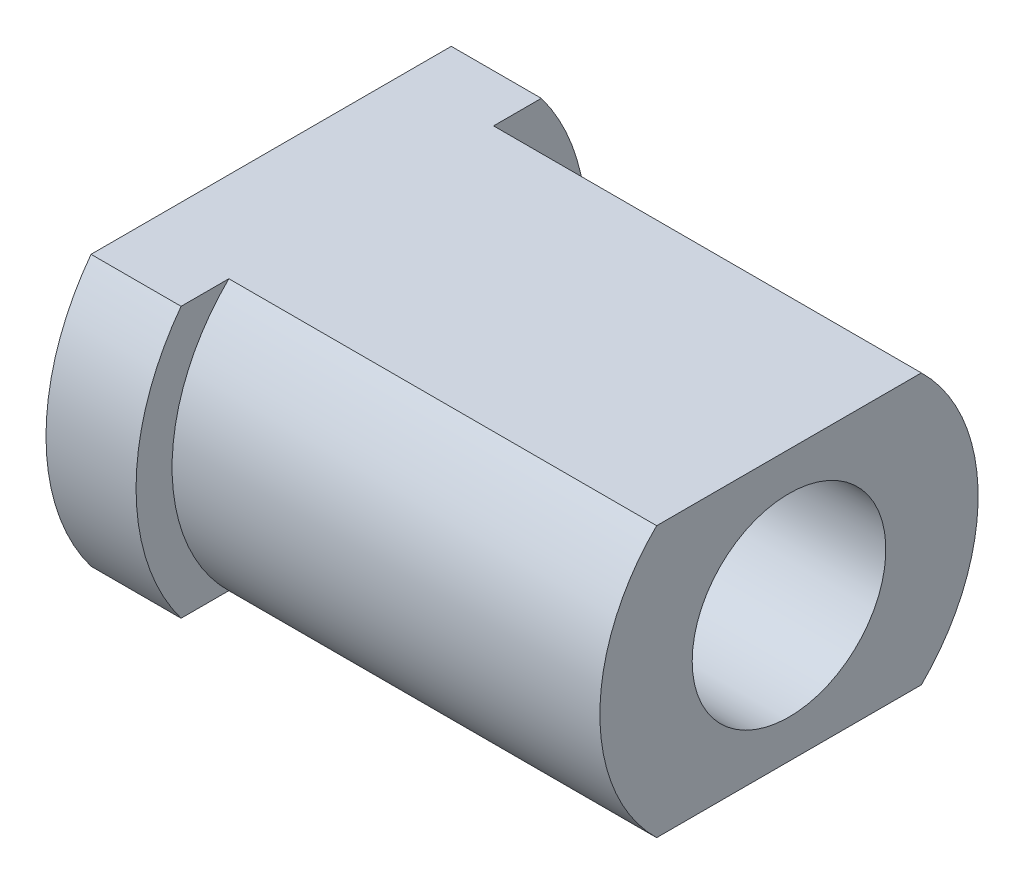
ISO-10303-21;
HEADER;
FILE_DESCRIPTION(('STEP AP214'),'2;1');
FILE_NAME('part.step','',(''),(''),'','','');
FILE_SCHEMA(('AUTOMOTIVE_DESIGN { 1 0 10303 214 1 1 1 1 }'));
ENDSEC;
DATA;
#1=APPLICATION_CONTEXT('core data for automotive mechanical design processes');
#2=APPLICATION_PROTOCOL_DEFINITION('international standard','automotive_design',2000,#1);
#3=PRODUCT_CONTEXT('',#1,'mechanical');
#4=PRODUCT('Part','Part','',(#3));
#5=PRODUCT_RELATED_PRODUCT_CATEGORY('part','',(#4));
#6=PRODUCT_DEFINITION_FORMATION('','',#4);
#7=PRODUCT_DEFINITION_CONTEXT('part definition',#1,'design');
#8=PRODUCT_DEFINITION('design','',#6,#7);
#9=PRODUCT_DEFINITION_SHAPE('','',#8);
#10=(LENGTH_UNIT() NAMED_UNIT(*) SI_UNIT(.MILLI.,.METRE.));
#11=(NAMED_UNIT(*) PLANE_ANGLE_UNIT() SI_UNIT($,.RADIAN.));
#12=(NAMED_UNIT(*) SI_UNIT($,.STERADIAN.) SOLID_ANGLE_UNIT());
#13=UNCERTAINTY_MEASURE_WITH_UNIT(LENGTH_MEASURE(1.E-05),#10,'distance_accuracy_value','');
#14=(GEOMETRIC_REPRESENTATION_CONTEXT(3) GLOBAL_UNCERTAINTY_ASSIGNED_CONTEXT((#13)) GLOBAL_UNIT_ASSIGNED_CONTEXT((#10,
#11,#12)) REPRESENTATION_CONTEXT('',''));
#15=CARTESIAN_POINT('',(0.,0.,0.));
#16=DIRECTION('',(0.,0.,1.));
#17=DIRECTION('',(1.,0.,0.));
#18=AXIS2_PLACEMENT_3D('',#15,#16,#17);
#19=CARTESIAN_POINT('',(0.,0.,0.));
#20=DIRECTION('',(-1.,0.,0.));
#21=DIRECTION('',(0.,-1.,0.));
#22=AXIS2_PLACEMENT_3D('',#19,#20,#21);
#23=CYLINDRICAL_SURFACE('',#22,1.27);
#24=DIRECTION('',(-1.,0.,0.));
#25=VECTOR('',#24,1.);
#26=CARTESIAN_POINT('',(0.,-0.762,1.016));
#27=LINE('',#26,#25);
#28=CARTESIAN_POINT('',(0.508,-0.762,1.016));
#29=VERTEX_POINT('',#28);
#30=CARTESIAN_POINT('',(0.,-0.762,1.016));
#31=VERTEX_POINT('',#30);
#32=EDGE_CURVE('E29',#29,#31,#27,.T.);
#33=ORIENTED_EDGE('',*,*,#32,.F.);
#34=CARTESIAN_POINT('',(0.508,0.,0.));
#35=DIRECTION('',(-1.,0.,0.));
#36=DIRECTION('',(0.,-1.,0.));
#37=AXIS2_PLACEMENT_3D('',#34,#35,#36);
#38=CIRCLE('',#37,1.27);
#39=CARTESIAN_POINT('',(0.508,0.762,1.016));
#40=VERTEX_POINT('',#39);
#41=EDGE_CURVE('E109',#29,#40,#38,.T.);
#42=ORIENTED_EDGE('',*,*,#41,.T.);
#43=DIRECTION('',(-1.,0.,0.));
#44=VECTOR('',#43,1.);
#45=CARTESIAN_POINT('',(0.,0.762,1.016));
#46=LINE('',#45,#44);
#47=CARTESIAN_POINT('',(0.,0.761999999999999,1.016));
#48=VERTEX_POINT('',#47);
#49=EDGE_CURVE('E114',#48,#40,#46,.F.);
#50=ORIENTED_EDGE('',*,*,#49,.F.);
#51=CARTESIAN_POINT('',(0.,0.,0.));
#52=DIRECTION('',(-1.,0.,0.));
#53=DIRECTION('',(0.,-1.,0.));
#54=AXIS2_PLACEMENT_3D('',#51,#52,#53);
#55=CIRCLE('',#54,1.27);
#56=EDGE_CURVE('E96',#31,#48,#55,.T.);
#57=ORIENTED_EDGE('',*,*,#56,.F.);
#58=EDGE_LOOP('',(#33,#42,#50,#57));
#59=FACE_BOUND('',#58,.T.);
#60=ADVANCED_FACE('F16',(#59),#23,.T.);
#61=DIRECTION('',(-1.,0.,0.));
#62=VECTOR('',#61,1.);
#63=CARTESIAN_POINT('',(0.,-0.762,-1.016));
#64=LINE('',#63,#62);
#65=CARTESIAN_POINT('',(0.,-0.762,-1.016));
#66=VERTEX_POINT('',#65);
#67=CARTESIAN_POINT('',(0.508,-0.762,-1.016));
#68=VERTEX_POINT('',#67);
#69=EDGE_CURVE('E79',#66,#68,#64,.F.);
#70=ORIENTED_EDGE('',*,*,#69,.F.);
#71=CARTESIAN_POINT('',(0.,0.762,-1.016));
#72=VERTEX_POINT('',#71);
#73=EDGE_CURVE('E88',#72,#66,#55,.T.);
#74=ORIENTED_EDGE('',*,*,#73,.F.);
#75=DIRECTION('',(-1.,0.,0.));
#76=VECTOR('',#75,1.);
#77=CARTESIAN_POINT('',(0.,0.762,-1.016));
#78=LINE('',#77,#76);
#79=CARTESIAN_POINT('',(0.508,0.762,-1.016));
#80=VERTEX_POINT('',#79);
#81=EDGE_CURVE('E37',#80,#72,#78,.T.);
#82=ORIENTED_EDGE('',*,*,#81,.F.);
#83=EDGE_CURVE('E90',#80,#68,#38,.T.);
#84=ORIENTED_EDGE('',*,*,#83,.T.);
#85=EDGE_LOOP('',(#70,#74,#82,#84));
#86=FACE_BOUND('',#85,.T.);
#87=ADVANCED_FACE('F87',(#86),#23,.T.);
#88=CARTESIAN_POINT('',(0.508,1.27,0.));
#89=DIRECTION('',(-1.,0.,0.));
#90=DIRECTION('',(0.,-1.,0.));
#91=AXIS2_PLACEMENT_3D('',#88,#89,#90);
#92=PLANE('',#91);
#93=DIRECTION('',(0.,0.,1.));
#94=VECTOR('',#93,1.);
#95=CARTESIAN_POINT('',(0.508,-0.762,0.));
#96=LINE('',#95,#94);
#97=CARTESIAN_POINT('',(0.508,-0.762,-0.746604473600313));
#98=VERTEX_POINT('',#97);
#99=EDGE_CURVE('E92',#68,#98,#96,.T.);
#100=ORIENTED_EDGE('',*,*,#99,.F.);
#101=ORIENTED_EDGE('',*,*,#83,.F.);
#102=DIRECTION('',(0.,0.,-1.));
#103=VECTOR('',#102,1.);
#104=CARTESIAN_POINT('',(0.508,0.762,0.));
#105=LINE('',#104,#103);
#106=CARTESIAN_POINT('',(0.508,0.762,-0.746604473600313));
#107=VERTEX_POINT('',#106);
#108=EDGE_CURVE('E121',#107,#80,#105,.T.);
#109=ORIENTED_EDGE('',*,*,#108,.F.);
#110=CARTESIAN_POINT('',(0.508,0.,0.));
#111=DIRECTION('',(-1.,0.,0.));
#112=DIRECTION('',(0.,-1.,0.));
#113=AXIS2_PLACEMENT_3D('',#110,#111,#112);
#114=CIRCLE('',#113,1.0668);
#115=EDGE_CURVE('E106',#107,#98,#114,.T.);
#116=ORIENTED_EDGE('',*,*,#115,.T.);
#117=EDGE_LOOP('',(#100,#101,#109,#116));
#118=FACE_BOUND('',#117,.T.);
#119=ADVANCED_FACE('F159',(#118),#92,.F.);
#120=CARTESIAN_POINT('',(0.508,-0.762,0.746604473600313));
#121=VERTEX_POINT('',#120);
#122=EDGE_CURVE('E202',#121,#29,#96,.T.);
#123=ORIENTED_EDGE('',*,*,#122,.F.);
#124=CARTESIAN_POINT('',(0.508,0.762,0.746604473600313));
#125=VERTEX_POINT('',#124);
#126=EDGE_CURVE('E105',#121,#125,#114,.T.);
#127=ORIENTED_EDGE('',*,*,#126,.T.);
#128=EDGE_CURVE('E119',#40,#125,#105,.T.);
#129=ORIENTED_EDGE('',*,*,#128,.F.);
#130=ORIENTED_EDGE('',*,*,#41,.F.);
#131=EDGE_LOOP('',(#123,#127,#129,#130));
#132=FACE_BOUND('',#131,.T.);
#133=ADVANCED_FACE('F164',(#132),#92,.F.);
#134=CARTESIAN_POINT('',(0.,0.,0.));
#135=DIRECTION('',(-1.,0.,0.));
#136=DIRECTION('',(0.,-1.,0.));
#137=AXIS2_PLACEMENT_3D('',#134,#135,#136);
#138=CYLINDRICAL_SURFACE('',#137,1.0668);
#139=DIRECTION('',(-1.,0.,0.));
#140=VECTOR('',#139,1.);
#141=CARTESIAN_POINT('',(0.,-0.762,0.746604473600313));
#142=LINE('',#141,#140);
#143=CARTESIAN_POINT('',(2.921,-0.762,0.746604473600313));
#144=VERTEX_POINT('',#143);
#145=EDGE_CURVE('E91',#144,#121,#142,.T.);
#146=ORIENTED_EDGE('',*,*,#145,.F.);
#147=CARTESIAN_POINT('',(2.921,0.,0.));
#148=DIRECTION('',(-1.,0.,0.));
#149=DIRECTION('',(0.,-1.,0.));
#150=AXIS2_PLACEMENT_3D('',#147,#148,#149);
#151=CIRCLE('',#150,1.0668);
#152=CARTESIAN_POINT('',(2.921,0.762,0.746604473600313));
#153=VERTEX_POINT('',#152);
#154=EDGE_CURVE('E95',#144,#153,#151,.T.);
#155=ORIENTED_EDGE('',*,*,#154,.T.);
#156=DIRECTION('',(-1.,0.,0.));
#157=VECTOR('',#156,1.);
#158=CARTESIAN_POINT('',(0.,0.762,0.746604473600313));
#159=LINE('',#158,#157);
#160=EDGE_CURVE('E123',#125,#153,#159,.F.);
#161=ORIENTED_EDGE('',*,*,#160,.F.);
#162=ORIENTED_EDGE('',*,*,#126,.F.);
#163=EDGE_LOOP('',(#146,#155,#161,#162));
#164=FACE_BOUND('',#163,.T.);
#165=ADVANCED_FACE('F170',(#164),#138,.T.);
#166=DIRECTION('',(-1.,0.,0.));
#167=VECTOR('',#166,1.);
#168=CARTESIAN_POINT('',(0.,-0.762,-0.746604473600313));
#169=LINE('',#168,#167);
#170=CARTESIAN_POINT('',(2.921,-0.762,-0.746604473600313));
#171=VERTEX_POINT('',#170);
#172=EDGE_CURVE('E188',#98,#171,#169,.F.);
#173=ORIENTED_EDGE('',*,*,#172,.F.);
#174=ORIENTED_EDGE('',*,*,#115,.F.);
#175=DIRECTION('',(-1.,0.,0.));
#176=VECTOR('',#175,1.);
#177=CARTESIAN_POINT('',(0.,0.762,-0.746604473600313));
#178=LINE('',#177,#176);
#179=CARTESIAN_POINT('',(2.921,0.762,-0.746604473600313));
#180=VERTEX_POINT('',#179);
#181=EDGE_CURVE('E118',#180,#107,#178,.T.);
#182=ORIENTED_EDGE('',*,*,#181,.F.);
#183=EDGE_CURVE('E98',#180,#171,#151,.T.);
#184=ORIENTED_EDGE('',*,*,#183,.T.);
#185=EDGE_LOOP('',(#173,#174,#182,#184));
#186=FACE_BOUND('',#185,.T.);
#187=ADVANCED_FACE('F175',(#186),#138,.T.);
#188=CARTESIAN_POINT('',(2.921,1.0668,0.));
#189=DIRECTION('',(-1.,0.,0.));
#190=DIRECTION('',(0.,-1.,0.));
#191=AXIS2_PLACEMENT_3D('',#188,#189,#190);
#192=PLANE('',#191);
#193=CARTESIAN_POINT('',(2.921,0.,0.));
#194=DIRECTION('',(-1.,0.,0.));
#195=DIRECTION('',(0.,0.,1.));
#196=AXIS2_PLACEMENT_3D('',#193,#194,#195);
#197=CIRCLE('',#196,0.5461);
#198=CARTESIAN_POINT('',(2.921,0.,0.5461));
#199=VERTEX_POINT('',#198);
#200=EDGE_CURVE('E100',#199,#199,#197,.T.);
#201=ORIENTED_EDGE('',*,*,#200,.T.);
#202=EDGE_LOOP('',(#201));
#203=FACE_BOUND('',#202,.T.);
#204=DIRECTION('',(0.,0.,1.));
#205=VECTOR('',#204,1.);
#206=CARTESIAN_POINT('',(2.921,-0.762,-1.27));
#207=LINE('',#206,#205);
#208=EDGE_CURVE('E192',#171,#144,#207,.T.);
#209=ORIENTED_EDGE('',*,*,#208,.F.);
#210=ORIENTED_EDGE('',*,*,#183,.F.);
#211=DIRECTION('',(0.,0.,-1.));
#212=VECTOR('',#211,1.);
#213=CARTESIAN_POINT('',(2.921,0.762,-1.27));
#214=LINE('',#213,#212);
#215=EDGE_CURVE('E197',#153,#180,#214,.T.);
#216=ORIENTED_EDGE('',*,*,#215,.F.);
#217=ORIENTED_EDGE('',*,*,#154,.F.);
#218=EDGE_LOOP('',(#209,#210,#216,#217));
#219=FACE_BOUND('',#218,.T.);
#220=ADVANCED_FACE('F137',(#203,#219),#192,.F.);
#221=CARTESIAN_POINT('',(0.,0.,0.));
#222=DIRECTION('',(1.,0.,0.));
#223=DIRECTION('',(0.,1.,0.));
#224=AXIS2_PLACEMENT_3D('',#221,#222,#223);
#225=PLANE('',#224);
#226=CARTESIAN_POINT('',(0.,0.,0.));
#227=DIRECTION('',(-1.,0.,0.));
#228=DIRECTION('',(0.,0.,1.));
#229=AXIS2_PLACEMENT_3D('',#226,#227,#228);
#230=CIRCLE('',#229,0.698500000000001);
#231=CARTESIAN_POINT('',(0.,0.,0.698500000000001));
#232=VERTEX_POINT('',#231);
#233=EDGE_CURVE('E128',#232,#232,#230,.T.);
#234=ORIENTED_EDGE('',*,*,#233,.F.);
#235=EDGE_LOOP('',(#234));
#236=FACE_BOUND('',#235,.T.);
#237=DIRECTION('',(0.,0.,-1.));
#238=VECTOR('',#237,1.);
#239=CARTESIAN_POINT('',(0.,-0.762,0.));
#240=LINE('',#239,#238);
#241=EDGE_CURVE('E10',#31,#66,#240,.T.);
#242=ORIENTED_EDGE('',*,*,#241,.F.);
#243=ORIENTED_EDGE('',*,*,#56,.T.);
#244=DIRECTION('',(0.,0.,1.));
#245=VECTOR('',#244,1.);
#246=CARTESIAN_POINT('',(0.,0.762,0.));
#247=LINE('',#246,#245);
#248=EDGE_CURVE('E23',#72,#48,#247,.T.);
#249=ORIENTED_EDGE('',*,*,#248,.F.);
#250=ORIENTED_EDGE('',*,*,#73,.T.);
#251=EDGE_LOOP('',(#242,#243,#249,#250));
#252=FACE_BOUND('',#251,.T.);
#253=ADVANCED_FACE('F94',(#236,#252),#225,.F.);
#254=CARTESIAN_POINT('',(0.,0.,0.));
#255=DIRECTION('',(-1.,0.,0.));
#256=DIRECTION('',(0.,0.,1.));
#257=AXIS2_PLACEMENT_3D('',#254,#255,#256);
#258=CYLINDRICAL_SURFACE('',#257,0.546100000000006);
#259=ORIENTED_EDGE('',*,*,#200,.F.);
#260=EDGE_LOOP('',(#259));
#261=FACE_BOUND('',#260,.T.);
#262=CARTESIAN_POINT('',(0.152399999999983,0.,0.));
#263=DIRECTION('',(-1.,0.,0.));
#264=DIRECTION('',(0.,0.,1.));
#265=AXIS2_PLACEMENT_3D('',#262,#263,#264);
#266=CIRCLE('',#265,0.546100000000013);
#267=CARTESIAN_POINT('',(0.152399999999983,0.,0.546100000000013));
#268=VERTEX_POINT('',#267);
#269=EDGE_CURVE('E130',#268,#268,#266,.T.);
#270=ORIENTED_EDGE('',*,*,#269,.T.);
#271=EDGE_LOOP('',(#270));
#272=FACE_BOUND('',#271,.T.);
#273=ADVANCED_FACE('F140',(#261,#272),#258,.F.);
#274=CARTESIAN_POINT('',(0.,0.,0.));
#275=DIRECTION('',(-1.,0.,0.));
#276=DIRECTION('',(0.,0.,1.));
#277=AXIS2_PLACEMENT_3D('',#274,#275,#276);
#278=CONICAL_SURFACE('',#277,0.698500000000001,0.78539816339746);
#279=ORIENTED_EDGE('',*,*,#269,.F.);
#280=EDGE_LOOP('',(#279));
#281=FACE_BOUND('',#280,.T.);
#282=ORIENTED_EDGE('',*,*,#233,.T.);
#283=EDGE_LOOP('',(#282));
#284=FACE_BOUND('',#283,.T.);
#285=ADVANCED_FACE('F142',(#281,#284),#278,.F.);
#286=CARTESIAN_POINT('',(2.921,0.762,-1.27));
#287=DIRECTION('',(0.,1.,0.));
#288=DIRECTION('',(0.,0.,1.));
#289=AXIS2_PLACEMENT_3D('',#286,#287,#288);
#290=PLANE('',#289);
#291=ORIENTED_EDGE('',*,*,#81,.T.);
#292=ORIENTED_EDGE('',*,*,#248,.T.);
#293=ORIENTED_EDGE('',*,*,#49,.T.);
#294=ORIENTED_EDGE('',*,*,#128,.T.);
#295=ORIENTED_EDGE('',*,*,#160,.T.);
#296=ORIENTED_EDGE('',*,*,#215,.T.);
#297=ORIENTED_EDGE('',*,*,#181,.T.);
#298=ORIENTED_EDGE('',*,*,#108,.T.);
#299=EDGE_LOOP('',(#291,#292,#293,#294,#295,#296,#297,#298));
#300=FACE_BOUND('',#299,.T.);
#301=ADVANCED_FACE('F112',(#300),#290,.T.);
#302=CARTESIAN_POINT('',(2.921,-0.762,-1.27));
#303=DIRECTION('',(0.,-1.,0.));
#304=DIRECTION('',(0.,0.,-1.));
#305=AXIS2_PLACEMENT_3D('',#302,#303,#304);
#306=PLANE('',#305);
#307=ORIENTED_EDGE('',*,*,#32,.T.);
#308=ORIENTED_EDGE('',*,*,#241,.T.);
#309=ORIENTED_EDGE('',*,*,#69,.T.);
#310=ORIENTED_EDGE('',*,*,#99,.T.);
#311=ORIENTED_EDGE('',*,*,#172,.T.);
#312=ORIENTED_EDGE('',*,*,#208,.T.);
#313=ORIENTED_EDGE('',*,*,#145,.T.);
#314=ORIENTED_EDGE('',*,*,#122,.T.);
#315=EDGE_LOOP('',(#307,#308,#309,#310,#311,#312,#313,#314));
#316=FACE_BOUND('',#315,.T.);
#317=ADVANCED_FACE('F78',(#316),#306,.T.);
#318=CLOSED_SHELL('',(#60,#87,#119,#133,#165,#187,#220,#253,#273,#285,#301,#317));
#319=MANIFOLD_SOLID_BREP('B1',#318);
#320=ADVANCED_BREP_SHAPE_REPRESENTATION('',(#18,#319),#14);
#321=SHAPE_DEFINITION_REPRESENTATION(#9,#320);
ENDSEC;
END-ISO-10303-21;
